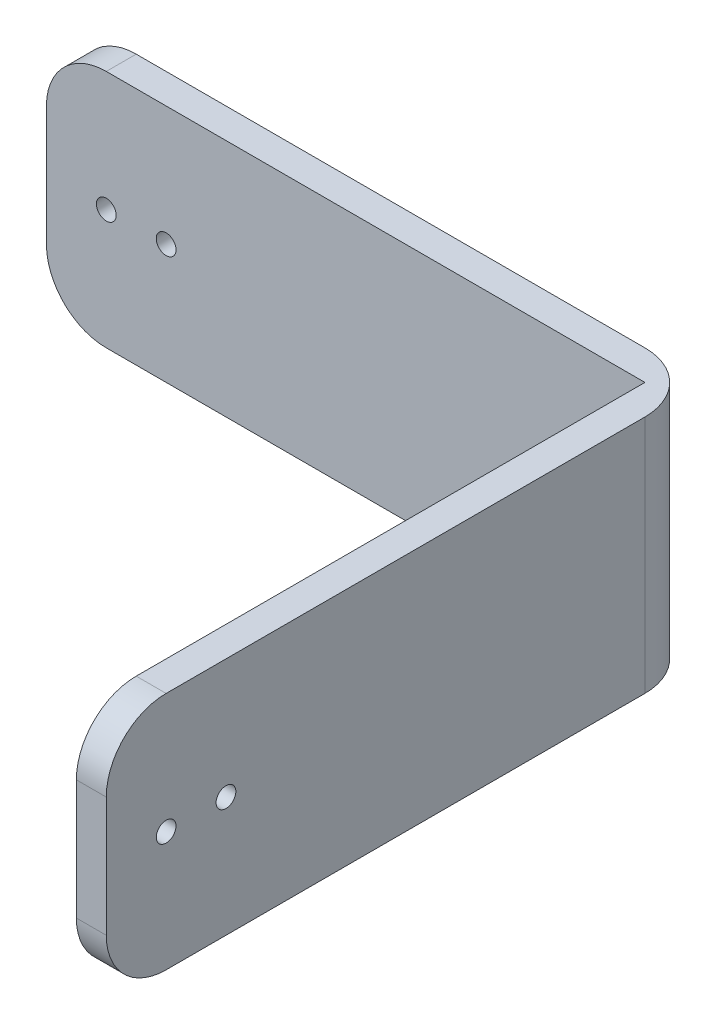
ISO-10303-21;
HEADER;
FILE_DESCRIPTION(('STEP AP214'),'2;1');
FILE_NAME('part.step','',(''),(''),'','','');
FILE_SCHEMA(('AUTOMOTIVE_DESIGN { 1 0 10303 214 1 1 1 1 }'));
ENDSEC;
DATA;
#1=APPLICATION_CONTEXT('core data for automotive mechanical design processes');
#2=APPLICATION_PROTOCOL_DEFINITION('international standard','automotive_design',2000,#1);
#3=PRODUCT_CONTEXT('',#1,'mechanical');
#4=PRODUCT('Part','Part','',(#3));
#5=PRODUCT_RELATED_PRODUCT_CATEGORY('part','',(#4));
#6=PRODUCT_DEFINITION_FORMATION('','',#4);
#7=PRODUCT_DEFINITION_CONTEXT('part definition',#1,'design');
#8=PRODUCT_DEFINITION('design','',#6,#7);
#9=PRODUCT_DEFINITION_SHAPE('','',#8);
#10=(LENGTH_UNIT() NAMED_UNIT(*) SI_UNIT(.MILLI.,.METRE.));
#11=(NAMED_UNIT(*) PLANE_ANGLE_UNIT() SI_UNIT($,.RADIAN.));
#12=(NAMED_UNIT(*) SI_UNIT($,.STERADIAN.) SOLID_ANGLE_UNIT());
#13=UNCERTAINTY_MEASURE_WITH_UNIT(LENGTH_MEASURE(1.E-05),#10,'distance_accuracy_value','');
#14=(GEOMETRIC_REPRESENTATION_CONTEXT(3) GLOBAL_UNCERTAINTY_ASSIGNED_CONTEXT((#13)) GLOBAL_UNIT_ASSIGNED_CONTEXT((#10,
#11,#12)) REPRESENTATION_CONTEXT('',''));
#15=CARTESIAN_POINT('',(0.,0.,0.));
#16=DIRECTION('',(0.,0.,1.));
#17=DIRECTION('',(1.,0.,0.));
#18=AXIS2_PLACEMENT_3D('',#15,#16,#17);
#19=CARTESIAN_POINT('',(-52.8295009050817,19.4147504525408,-1.));
#20=DIRECTION('',(0.,-1.,0.));
#21=DIRECTION('',(0.,0.,-1.));
#22=AXIS2_PLACEMENT_3D('',#19,#20,#21);
#23=PLANE('',#22);
#24=DIRECTION('',(1.,0.,0.));
#25=VECTOR('',#24,1.);
#26=CARTESIAN_POINT('',(-52.8295009050817,19.4147504525408,-1.));
#27=LINE('',#26,#25);
#28=CARTESIAN_POINT('',(-52.8295009050817,19.4147504525408,-1.));
#29=VERTEX_POINT('',#28);
#30=CARTESIAN_POINT('',(-35.8295009050817,19.4147504525408,-1.));
#31=VERTEX_POINT('',#30);
#32=EDGE_CURVE('E167',#29,#31,#27,.T.);
#33=ORIENTED_EDGE('',*,*,#32,.T.);
#34=CARTESIAN_POINT('',(-35.8295009050817,19.4147504525408,1.));
#35=DIRECTION('',(0.,-1.,0.));
#36=DIRECTION('',(0.,0.,-1.));
#37=AXIS2_PLACEMENT_3D('',#34,#35,#36);
#38=CIRCLE('',#37,2.);
#39=CARTESIAN_POINT('',(-33.8295009050817,19.4147504525408,1.));
#40=VERTEX_POINT('',#39);
#41=EDGE_CURVE('E11',#31,#40,#38,.T.);
#42=ORIENTED_EDGE('',*,*,#41,.T.);
#43=DIRECTION('',(0.,0.,-1.));
#44=VECTOR('',#43,1.);
#45=CARTESIAN_POINT('',(-33.8295009050817,19.4147504525408,-1.));
#46=LINE('',#45,#44);
#47=CARTESIAN_POINT('',(-33.8295009050817,19.4147504525408,17.));
#48=VERTEX_POINT('',#47);
#49=EDGE_CURVE('E143',#48,#40,#46,.T.);
#50=ORIENTED_EDGE('',*,*,#49,.F.);
#51=DIRECTION('',(-1.,0.,0.));
#52=VECTOR('',#51,1.);
#53=CARTESIAN_POINT('',(-33.8295009050817,19.4147504525408,17.));
#54=LINE('',#53,#52);
#55=CARTESIAN_POINT('',(-34.8295009050817,19.4147504525408,17.));
#56=VERTEX_POINT('',#55);
#57=EDGE_CURVE('E145',#48,#56,#54,.T.);
#58=ORIENTED_EDGE('',*,*,#57,.T.);
#59=DIRECTION('',(0.,0.,-1.));
#60=VECTOR('',#59,1.);
#61=CARTESIAN_POINT('',(-34.8295009050817,19.4147504525408,-1.));
#62=LINE('',#61,#60);
#63=CARTESIAN_POINT('',(-34.8295009050817,19.4147504525408,0.));
#64=VERTEX_POINT('',#63);
#65=EDGE_CURVE('E121',#56,#64,#62,.T.);
#66=ORIENTED_EDGE('',*,*,#65,.T.);
#67=DIRECTION('',(1.,0.,0.));
#68=VECTOR('',#67,1.);
#69=CARTESIAN_POINT('',(-52.8295009050817,19.4147504525408,0.));
#70=LINE('',#69,#68);
#71=CARTESIAN_POINT('',(-52.8295009050817,19.4147504525408,0.));
#72=VERTEX_POINT('',#71);
#73=EDGE_CURVE('E158',#72,#64,#70,.T.);
#74=ORIENTED_EDGE('',*,*,#73,.F.);
#75=DIRECTION('',(0.,0.,1.));
#76=VECTOR('',#75,1.);
#77=CARTESIAN_POINT('',(-52.8295009050817,19.4147504525408,-1.));
#78=LINE('',#77,#76);
#79=EDGE_CURVE('E196',#29,#72,#78,.T.);
#80=ORIENTED_EDGE('',*,*,#79,.F.);
#81=EDGE_LOOP('',(#33,#42,#50,#58,#66,#74,#80));
#82=FACE_BOUND('',#81,.T.);
#83=ADVANCED_FACE('F31',(#82),#23,.T.);
#84=CARTESIAN_POINT('',(-52.8295009050817,21.4147504525408,-1.));
#85=DIRECTION('',(0.,0.,1.));
#86=DIRECTION('',(1.,0.,0.));
#87=AXIS2_PLACEMENT_3D('',#84,#85,#86);
#88=CYLINDRICAL_SURFACE('',#87,2.);
#89=CARTESIAN_POINT('',(-52.8295009050817,21.4147504525408,0.));
#90=DIRECTION('',(0.,0.,1.));
#91=DIRECTION('',(1.,0.,0.));
#92=AXIS2_PLACEMENT_3D('',#89,#90,#91);
#93=CIRCLE('',#92,2.);
#94=CARTESIAN_POINT('',(-54.8295009050817,21.4147504525409,0.));
#95=VERTEX_POINT('',#94);
#96=EDGE_CURVE('E183',#95,#72,#93,.T.);
#97=ORIENTED_EDGE('',*,*,#96,.F.);
#98=DIRECTION('',(0.,0.,1.));
#99=VECTOR('',#98,1.);
#100=CARTESIAN_POINT('',(-54.8295009050817,21.4147504525409,-1.));
#101=LINE('',#100,#99);
#102=CARTESIAN_POINT('',(-54.8295009050817,21.4147504525409,-1.));
#103=VERTEX_POINT('',#102);
#104=EDGE_CURVE('E197',#103,#95,#101,.T.);
#105=ORIENTED_EDGE('',*,*,#104,.F.);
#106=CARTESIAN_POINT('',(-52.8295009050817,21.4147504525408,-1.));
#107=DIRECTION('',(0.,0.,1.));
#108=DIRECTION('',(1.,0.,0.));
#109=AXIS2_PLACEMENT_3D('',#106,#107,#108);
#110=CIRCLE('',#109,2.);
#111=EDGE_CURVE('E164',#103,#29,#110,.T.);
#112=ORIENTED_EDGE('',*,*,#111,.T.);
#113=ORIENTED_EDGE('',*,*,#79,.T.);
#114=EDGE_LOOP('',(#97,#105,#112,#113));
#115=FACE_BOUND('',#114,.T.);
#116=ADVANCED_FACE('F247',(#115),#88,.T.);
#117=CARTESIAN_POINT('',(-54.8295009050817,25.4147504525408,-1.));
#118=DIRECTION('',(-1.,0.,0.));
#119=DIRECTION('',(0.,0.,1.));
#120=AXIS2_PLACEMENT_3D('',#117,#118,#119);
#121=PLANE('',#120);
#122=DIRECTION('',(0.,-1.,0.));
#123=VECTOR('',#122,1.);
#124=CARTESIAN_POINT('',(-54.8295009050817,25.4147504525408,0.));
#125=LINE('',#124,#123);
#126=CARTESIAN_POINT('',(-54.8295009050817,25.4147504525408,0.));
#127=VERTEX_POINT('',#126);
#128=EDGE_CURVE('E210',#127,#95,#125,.T.);
#129=ORIENTED_EDGE('',*,*,#128,.F.);
#130=DIRECTION('',(0.,0.,1.));
#131=VECTOR('',#130,1.);
#132=CARTESIAN_POINT('',(-54.8295009050817,25.4147504525408,-1.));
#133=LINE('',#132,#131);
#134=CARTESIAN_POINT('',(-54.8295009050817,25.4147504525408,-1.));
#135=VERTEX_POINT('',#134);
#136=EDGE_CURVE('E202',#135,#127,#133,.T.);
#137=ORIENTED_EDGE('',*,*,#136,.F.);
#138=DIRECTION('',(0.,-1.,0.));
#139=VECTOR('',#138,1.);
#140=CARTESIAN_POINT('',(-54.8295009050817,25.4147504525408,-1.));
#141=LINE('',#140,#139);
#142=EDGE_CURVE('E161',#135,#103,#141,.T.);
#143=ORIENTED_EDGE('',*,*,#142,.T.);
#144=ORIENTED_EDGE('',*,*,#104,.T.);
#145=EDGE_LOOP('',(#129,#137,#143,#144));
#146=FACE_BOUND('',#145,.T.);
#147=ADVANCED_FACE('F245',(#146),#121,.T.);
#148=CARTESIAN_POINT('',(-52.8295009050817,25.4147504525408,-1.));
#149=DIRECTION('',(0.,0.,1.));
#150=DIRECTION('',(1.,0.,0.));
#151=AXIS2_PLACEMENT_3D('',#148,#149,#150);
#152=CYLINDRICAL_SURFACE('',#151,2.);
#153=CARTESIAN_POINT('',(-52.8295009050817,25.4147504525408,0.));
#154=DIRECTION('',(0.,0.,1.));
#155=DIRECTION('',(1.,0.,0.));
#156=AXIS2_PLACEMENT_3D('',#153,#154,#155);
#157=CIRCLE('',#156,2.);
#158=CARTESIAN_POINT('',(-52.8295009050817,27.4147504525408,0.));
#159=VERTEX_POINT('',#158);
#160=EDGE_CURVE('E172',#159,#127,#157,.T.);
#161=ORIENTED_EDGE('',*,*,#160,.F.);
#162=DIRECTION('',(0.,0.,1.));
#163=VECTOR('',#162,1.);
#164=CARTESIAN_POINT('',(-52.8295009050817,27.4147504525408,-1.));
#165=LINE('',#164,#163);
#166=CARTESIAN_POINT('',(-52.8295009050817,27.4147504525408,-1.));
#167=VERTEX_POINT('',#166);
#168=EDGE_CURVE('E169',#167,#159,#165,.T.);
#169=ORIENTED_EDGE('',*,*,#168,.F.);
#170=CARTESIAN_POINT('',(-52.8295009050817,25.4147504525408,-1.));
#171=DIRECTION('',(0.,0.,1.));
#172=DIRECTION('',(1.,0.,0.));
#173=AXIS2_PLACEMENT_3D('',#170,#171,#172);
#174=CIRCLE('',#173,2.);
#175=EDGE_CURVE('E157',#167,#135,#174,.T.);
#176=ORIENTED_EDGE('',*,*,#175,.T.);
#177=ORIENTED_EDGE('',*,*,#136,.T.);
#178=EDGE_LOOP('',(#161,#169,#176,#177));
#179=FACE_BOUND('',#178,.T.);
#180=ADVANCED_FACE('F242',(#179),#152,.T.);
#181=CARTESIAN_POINT('',(-52.8295009050817,27.4147504525408,-1.));
#182=DIRECTION('',(0.,1.,0.));
#183=DIRECTION('',(0.,0.,1.));
#184=AXIS2_PLACEMENT_3D('',#181,#182,#183);
#185=PLANE('',#184);
#186=DIRECTION('',(0.,0.,1.));
#187=VECTOR('',#186,1.);
#188=CARTESIAN_POINT('',(-33.8295009050817,27.4147504525408,-1.));
#189=LINE('',#188,#187);
#190=CARTESIAN_POINT('',(-33.8295009050817,27.4147504525408,1.));
#191=VERTEX_POINT('',#190);
#192=CARTESIAN_POINT('',(-33.8295009050817,27.4147504525408,17.));
#193=VERTEX_POINT('',#192);
#194=EDGE_CURVE('E112',#191,#193,#189,.T.);
#195=ORIENTED_EDGE('',*,*,#194,.F.);
#196=CARTESIAN_POINT('',(-35.8295009050817,27.4147504525408,1.));
#197=DIRECTION('',(0.,1.,0.));
#198=DIRECTION('',(0.,0.,1.));
#199=AXIS2_PLACEMENT_3D('',#196,#197,#198);
#200=CIRCLE('',#199,2.);
#201=CARTESIAN_POINT('',(-35.8295009050817,27.4147504525408,-1.));
#202=VERTEX_POINT('',#201);
#203=EDGE_CURVE('E53',#191,#202,#200,.T.);
#204=ORIENTED_EDGE('',*,*,#203,.T.);
#205=DIRECTION('',(-1.,0.,0.));
#206=VECTOR('',#205,1.);
#207=CARTESIAN_POINT('',(-52.8295009050817,27.4147504525408,-1.));
#208=LINE('',#207,#206);
#209=EDGE_CURVE('E155',#202,#167,#208,.T.);
#210=ORIENTED_EDGE('',*,*,#209,.T.);
#211=ORIENTED_EDGE('',*,*,#168,.T.);
#212=DIRECTION('',(-1.,0.,0.));
#213=VECTOR('',#212,1.);
#214=CARTESIAN_POINT('',(-52.8295009050817,27.4147504525408,0.));
#215=LINE('',#214,#213);
#216=CARTESIAN_POINT('',(-34.8295009050817,27.4147504525408,0.));
#217=VERTEX_POINT('',#216);
#218=EDGE_CURVE('E178',#217,#159,#215,.T.);
#219=ORIENTED_EDGE('',*,*,#218,.F.);
#220=DIRECTION('',(0.,0.,1.));
#221=VECTOR('',#220,1.);
#222=CARTESIAN_POINT('',(-34.8295009050817,27.4147504525408,-1.));
#223=LINE('',#222,#221);
#224=CARTESIAN_POINT('',(-34.8295009050817,27.4147504525408,17.));
#225=VERTEX_POINT('',#224);
#226=EDGE_CURVE('E127',#217,#225,#223,.T.);
#227=ORIENTED_EDGE('',*,*,#226,.T.);
#228=DIRECTION('',(-1.,0.,0.));
#229=VECTOR('',#228,1.);
#230=CARTESIAN_POINT('',(-33.8295009050817,27.4147504525408,17.));
#231=LINE('',#230,#229);
#232=EDGE_CURVE('E124',#193,#225,#231,.T.);
#233=ORIENTED_EDGE('',*,*,#232,.F.);
#234=EDGE_LOOP('',(#195,#204,#210,#211,#219,#227,#233));
#235=FACE_BOUND('',#234,.T.);
#236=ADVANCED_FACE('F125',(#235),#185,.T.);
#237=CARTESIAN_POINT('',(-52.8295009050817,21.4147504525408,-1.));
#238=DIRECTION('',(0.,0.,1.));
#239=DIRECTION('',(1.,0.,0.));
#240=AXIS2_PLACEMENT_3D('',#237,#238,#239);
#241=PLANE('',#240);
#242=CARTESIAN_POINT('',(-50.8295009050817,23.4147504525408,-1.));
#243=DIRECTION('',(0.,0.,1.));
#244=DIRECTION('',(1.,0.,0.));
#245=AXIS2_PLACEMENT_3D('',#242,#243,#244);
#246=CIRCLE('',#245,0.330199999999996);
#247=CARTESIAN_POINT('',(-50.4993009050817,23.4147504525408,-1.));
#248=VERTEX_POINT('',#247);
#249=EDGE_CURVE('E320',#248,#248,#246,.T.);
#250=ORIENTED_EDGE('',*,*,#249,.T.);
#251=EDGE_LOOP('',(#250));
#252=FACE_BOUND('',#251,.T.);
#253=CARTESIAN_POINT('',(-52.8295009050817,23.4147504525408,-0.999999999999994));
#254=DIRECTION('',(0.,0.,1.));
#255=DIRECTION('',(1.,0.,0.));
#256=AXIS2_PLACEMENT_3D('',#253,#254,#255);
#257=CIRCLE('',#256,0.330200000000003);
#258=CARTESIAN_POINT('',(-52.4993009050817,23.4147504525408,-0.999999999999994));
#259=VERTEX_POINT('',#258);
#260=EDGE_CURVE('E153',#259,#259,#257,.T.);
#261=ORIENTED_EDGE('',*,*,#260,.T.);
#262=EDGE_LOOP('',(#261));
#263=FACE_BOUND('',#262,.T.);
#264=ORIENTED_EDGE('',*,*,#209,.F.);
#265=DIRECTION('',(0.,1.,0.));
#266=VECTOR('',#265,1.);
#267=CARTESIAN_POINT('',(-35.8295009050817,19.4147504525408,-1.));
#268=LINE('',#267,#266);
#269=EDGE_CURVE('E39',#202,#31,#268,.F.);
#270=ORIENTED_EDGE('',*,*,#269,.T.);
#271=ORIENTED_EDGE('',*,*,#32,.F.);
#272=ORIENTED_EDGE('',*,*,#111,.F.);
#273=ORIENTED_EDGE('',*,*,#142,.F.);
#274=ORIENTED_EDGE('',*,*,#175,.F.);
#275=EDGE_LOOP('',(#264,#270,#271,#272,#273,#274));
#276=FACE_BOUND('',#275,.T.);
#277=ADVANCED_FACE('F248',(#252,#263,#276),#241,.F.);
#278=CARTESIAN_POINT('',(-52.8295009050817,21.4147504525408,0.));
#279=DIRECTION('',(0.,0.,1.));
#280=DIRECTION('',(1.,0.,0.));
#281=AXIS2_PLACEMENT_3D('',#278,#279,#280);
#282=PLANE('',#281);
#283=CARTESIAN_POINT('',(-50.8295009050817,23.4147504525408,0.));
#284=DIRECTION('',(0.,0.,1.));
#285=DIRECTION('',(1.,0.,0.));
#286=AXIS2_PLACEMENT_3D('',#283,#284,#285);
#287=CIRCLE('',#286,0.330199999999989);
#288=CARTESIAN_POINT('',(-50.4993009050817,23.4147504525408,0.));
#289=VERTEX_POINT('',#288);
#290=EDGE_CURVE('E189',#289,#289,#287,.T.);
#291=ORIENTED_EDGE('',*,*,#290,.F.);
#292=EDGE_LOOP('',(#291));
#293=FACE_BOUND('',#292,.T.);
#294=CARTESIAN_POINT('',(-52.8295009050817,23.4147504525408,0.));
#295=DIRECTION('',(0.,0.,1.));
#296=DIRECTION('',(1.,0.,0.));
#297=AXIS2_PLACEMENT_3D('',#294,#295,#296);
#298=CIRCLE('',#297,0.330200000000003);
#299=CARTESIAN_POINT('',(-52.4993009050817,23.4147504525408,0.));
#300=VERTEX_POINT('',#299);
#301=EDGE_CURVE('E322',#300,#300,#298,.T.);
#302=ORIENTED_EDGE('',*,*,#301,.F.);
#303=EDGE_LOOP('',(#302));
#304=FACE_BOUND('',#303,.T.);
#305=DIRECTION('',(0.,1.,0.));
#306=VECTOR('',#305,1.);
#307=CARTESIAN_POINT('',(-34.8295009050817,27.4147504525408,0.));
#308=LINE('',#307,#306);
#309=EDGE_CURVE('E130',#64,#217,#308,.T.);
#310=ORIENTED_EDGE('',*,*,#309,.T.);
#311=ORIENTED_EDGE('',*,*,#218,.T.);
#312=ORIENTED_EDGE('',*,*,#160,.T.);
#313=ORIENTED_EDGE('',*,*,#128,.T.);
#314=ORIENTED_EDGE('',*,*,#96,.T.);
#315=ORIENTED_EDGE('',*,*,#73,.T.);
#316=EDGE_LOOP('',(#310,#311,#312,#313,#314,#315));
#317=FACE_BOUND('',#316,.T.);
#318=ADVANCED_FACE('F215',(#293,#304,#317),#282,.T.);
#319=CARTESIAN_POINT('',(-33.8295009050817,25.4147504525408,17.));
#320=DIRECTION('',(-1.,0.,0.));
#321=DIRECTION('',(0.,0.,1.));
#322=AXIS2_PLACEMENT_3D('',#319,#320,#321);
#323=CYLINDRICAL_SURFACE('',#322,2.);
#324=CARTESIAN_POINT('',(-34.8295009050817,25.4147504525408,17.));
#325=DIRECTION('',(1.,0.,0.));
#326=DIRECTION('',(0.,0.,1.));
#327=AXIS2_PLACEMENT_3D('',#324,#325,#326);
#328=CIRCLE('',#327,2.);
#329=CARTESIAN_POINT('',(-34.8295009050817,25.4147504525408,19.));
#330=VERTEX_POINT('',#329);
#331=EDGE_CURVE('E148',#225,#330,#328,.T.);
#332=ORIENTED_EDGE('',*,*,#331,.T.);
#333=DIRECTION('',(-1.,0.,0.));
#334=VECTOR('',#333,1.);
#335=CARTESIAN_POINT('',(-33.8295009050817,25.4147504525408,19.));
#336=LINE('',#335,#334);
#337=CARTESIAN_POINT('',(-33.8295009050817,25.4147504525408,19.));
#338=VERTEX_POINT('',#337);
#339=EDGE_CURVE('E131',#338,#330,#336,.T.);
#340=ORIENTED_EDGE('',*,*,#339,.F.);
#341=CARTESIAN_POINT('',(-33.8295009050817,25.4147504525408,17.));
#342=DIRECTION('',(1.,0.,0.));
#343=DIRECTION('',(0.,0.,1.));
#344=AXIS2_PLACEMENT_3D('',#341,#342,#343);
#345=CIRCLE('',#344,2.);
#346=EDGE_CURVE('E117',#193,#338,#345,.T.);
#347=ORIENTED_EDGE('',*,*,#346,.F.);
#348=ORIENTED_EDGE('',*,*,#232,.T.);
#349=EDGE_LOOP('',(#332,#340,#347,#348));
#350=FACE_BOUND('',#349,.T.);
#351=ADVANCED_FACE('F133',(#350),#323,.T.);
#352=CARTESIAN_POINT('',(-33.8295009050817,25.4147504525408,19.));
#353=DIRECTION('',(0.,0.,-1.));
#354=DIRECTION('',(0.,1.,0.));
#355=AXIS2_PLACEMENT_3D('',#352,#353,#354);
#356=PLANE('',#355);
#357=DIRECTION('',(0.,-1.,0.));
#358=VECTOR('',#357,1.);
#359=CARTESIAN_POINT('',(-34.8295009050817,25.4147504525408,19.));
#360=LINE('',#359,#358);
#361=CARTESIAN_POINT('',(-34.8295009050817,21.4147504525409,19.));
#362=VERTEX_POINT('',#361);
#363=EDGE_CURVE('E225',#330,#362,#360,.T.);
#364=ORIENTED_EDGE('',*,*,#363,.T.);
#365=DIRECTION('',(-1.,0.,0.));
#366=VECTOR('',#365,1.);
#367=CARTESIAN_POINT('',(-33.8295009050817,21.4147504525409,19.));
#368=LINE('',#367,#366);
#369=CARTESIAN_POINT('',(-33.8295009050817,21.4147504525409,19.));
#370=VERTEX_POINT('',#369);
#371=EDGE_CURVE('E232',#370,#362,#368,.T.);
#372=ORIENTED_EDGE('',*,*,#371,.F.);
#373=DIRECTION('',(0.,-1.,0.));
#374=VECTOR('',#373,1.);
#375=CARTESIAN_POINT('',(-33.8295009050817,25.4147504525408,19.));
#376=LINE('',#375,#374);
#377=EDGE_CURVE('E136',#338,#370,#376,.T.);
#378=ORIENTED_EDGE('',*,*,#377,.F.);
#379=ORIENTED_EDGE('',*,*,#339,.T.);
#380=EDGE_LOOP('',(#364,#372,#378,#379));
#381=FACE_BOUND('',#380,.T.);
#382=ADVANCED_FACE('F236',(#381),#356,.F.);
#383=CARTESIAN_POINT('',(-33.8295009050817,21.4147504525408,17.));
#384=DIRECTION('',(-1.,0.,0.));
#385=DIRECTION('',(0.,0.,1.));
#386=AXIS2_PLACEMENT_3D('',#383,#384,#385);
#387=CYLINDRICAL_SURFACE('',#386,2.);
#388=CARTESIAN_POINT('',(-34.8295009050817,21.4147504525408,17.));
#389=DIRECTION('',(1.,0.,0.));
#390=DIRECTION('',(0.,0.,-1.));
#391=AXIS2_PLACEMENT_3D('',#388,#389,#390);
#392=CIRCLE('',#391,2.);
#393=EDGE_CURVE('E224',#362,#56,#392,.T.);
#394=ORIENTED_EDGE('',*,*,#393,.T.);
#395=ORIENTED_EDGE('',*,*,#57,.F.);
#396=CARTESIAN_POINT('',(-33.8295009050817,21.4147504525408,17.));
#397=DIRECTION('',(1.,0.,0.));
#398=DIRECTION('',(0.,0.,-1.));
#399=AXIS2_PLACEMENT_3D('',#396,#397,#398);
#400=CIRCLE('',#399,2.);
#401=EDGE_CURVE('E138',#370,#48,#400,.T.);
#402=ORIENTED_EDGE('',*,*,#401,.F.);
#403=ORIENTED_EDGE('',*,*,#371,.T.);
#404=EDGE_LOOP('',(#394,#395,#402,#403));
#405=FACE_BOUND('',#404,.T.);
#406=ADVANCED_FACE('F289',(#405),#387,.T.);
#407=CARTESIAN_POINT('',(-33.8295009050817,21.4147504525408,17.));
#408=DIRECTION('',(1.,0.,0.));
#409=DIRECTION('',(0.,0.,-1.));
#410=AXIS2_PLACEMENT_3D('',#407,#408,#409);
#411=PLANE('',#410);
#412=CARTESIAN_POINT('',(-33.8295009050817,23.4147504525408,15.));
#413=DIRECTION('',(1.,0.,0.));
#414=DIRECTION('',(0.,0.,-1.));
#415=AXIS2_PLACEMENT_3D('',#412,#413,#414);
#416=CIRCLE('',#415,0.330199999999985);
#417=CARTESIAN_POINT('',(-33.8295009050817,23.4147504525408,14.6698));
#418=VERTEX_POINT('',#417);
#419=EDGE_CURVE('E194',#418,#418,#416,.T.);
#420=ORIENTED_EDGE('',*,*,#419,.F.);
#421=EDGE_LOOP('',(#420));
#422=FACE_BOUND('',#421,.T.);
#423=CARTESIAN_POINT('',(-33.8295009050817,23.4147504525408,17.));
#424=DIRECTION('',(1.,0.,0.));
#425=DIRECTION('',(0.,0.,-1.));
#426=AXIS2_PLACEMENT_3D('',#423,#424,#425);
#427=CIRCLE('',#426,0.330199999999985);
#428=CARTESIAN_POINT('',(-33.8295009050817,23.4147504525408,16.6698));
#429=VERTEX_POINT('',#428);
#430=EDGE_CURVE('E190',#429,#429,#427,.T.);
#431=ORIENTED_EDGE('',*,*,#430,.F.);
#432=EDGE_LOOP('',(#431));
#433=FACE_BOUND('',#432,.T.);
#434=ORIENTED_EDGE('',*,*,#49,.T.);
#435=DIRECTION('',(0.,1.,0.));
#436=VECTOR('',#435,1.);
#437=CARTESIAN_POINT('',(-33.8295009050817,27.4147504525408,1.));
#438=LINE('',#437,#436);
#439=EDGE_CURVE('E120',#40,#191,#438,.T.);
#440=ORIENTED_EDGE('',*,*,#439,.T.);
#441=ORIENTED_EDGE('',*,*,#194,.T.);
#442=ORIENTED_EDGE('',*,*,#346,.T.);
#443=ORIENTED_EDGE('',*,*,#377,.T.);
#444=ORIENTED_EDGE('',*,*,#401,.T.);
#445=EDGE_LOOP('',(#434,#440,#441,#442,#443,#444));
#446=FACE_BOUND('',#445,.T.);
#447=ADVANCED_FACE('F115',(#422,#433,#446),#411,.T.);
#448=CARTESIAN_POINT('',(-34.8295009050817,21.4147504525408,17.));
#449=DIRECTION('',(1.,0.,0.));
#450=DIRECTION('',(0.,0.,-1.));
#451=AXIS2_PLACEMENT_3D('',#448,#449,#450);
#452=PLANE('',#451);
#453=CARTESIAN_POINT('',(-34.8295009050817,23.4147504525408,15.));
#454=DIRECTION('',(1.,0.,0.));
#455=DIRECTION('',(0.,0.,-1.));
#456=AXIS2_PLACEMENT_3D('',#453,#454,#455);
#457=CIRCLE('',#456,0.330199999999991);
#458=CARTESIAN_POINT('',(-34.8295009050817,23.4147504525408,14.6698));
#459=VERTEX_POINT('',#458);
#460=EDGE_CURVE('E191',#459,#459,#457,.T.);
#461=ORIENTED_EDGE('',*,*,#460,.T.);
#462=EDGE_LOOP('',(#461));
#463=FACE_BOUND('',#462,.T.);
#464=CARTESIAN_POINT('',(-34.8295009050817,23.4147504525408,17.));
#465=DIRECTION('',(1.,0.,0.));
#466=DIRECTION('',(0.,0.,-1.));
#467=AXIS2_PLACEMENT_3D('',#464,#465,#466);
#468=CIRCLE('',#467,0.330199999999991);
#469=CARTESIAN_POINT('',(-34.8295009050817,23.4147504525408,16.6698));
#470=VERTEX_POINT('',#469);
#471=EDGE_CURVE('E186',#470,#470,#468,.T.);
#472=ORIENTED_EDGE('',*,*,#471,.T.);
#473=EDGE_LOOP('',(#472));
#474=FACE_BOUND('',#473,.T.);
#475=ORIENTED_EDGE('',*,*,#309,.F.);
#476=ORIENTED_EDGE('',*,*,#65,.F.);
#477=ORIENTED_EDGE('',*,*,#393,.F.);
#478=ORIENTED_EDGE('',*,*,#363,.F.);
#479=ORIENTED_EDGE('',*,*,#331,.F.);
#480=ORIENTED_EDGE('',*,*,#226,.F.);
#481=EDGE_LOOP('',(#475,#476,#477,#478,#479,#480));
#482=FACE_BOUND('',#481,.T.);
#483=ADVANCED_FACE('F238',(#463,#474,#482),#452,.F.);
#484=CARTESIAN_POINT('',(-52.8295009050817,23.4147504525408,0.));
#485=DIRECTION('',(0.,0.,1.));
#486=DIRECTION('',(1.,0.,0.));
#487=AXIS2_PLACEMENT_3D('',#484,#485,#486);
#488=CYLINDRICAL_SURFACE('',#487,0.330200000000003);
#489=ORIENTED_EDGE('',*,*,#260,.F.);
#490=EDGE_LOOP('',(#489));
#491=FACE_BOUND('',#490,.T.);
#492=ORIENTED_EDGE('',*,*,#301,.T.);
#493=EDGE_LOOP('',(#492));
#494=FACE_BOUND('',#493,.T.);
#495=ADVANCED_FACE('F294',(#491,#494),#488,.F.);
#496=CARTESIAN_POINT('',(-50.8295009050817,23.4147504525408,0.));
#497=DIRECTION('',(0.,0.,1.));
#498=DIRECTION('',(1.,0.,0.));
#499=AXIS2_PLACEMENT_3D('',#496,#497,#498);
#500=CYLINDRICAL_SURFACE('',#499,0.330199999999992);
#501=ORIENTED_EDGE('',*,*,#249,.F.);
#502=EDGE_LOOP('',(#501));
#503=FACE_BOUND('',#502,.T.);
#504=ORIENTED_EDGE('',*,*,#290,.T.);
#505=EDGE_LOOP('',(#504));
#506=FACE_BOUND('',#505,.T.);
#507=ADVANCED_FACE('F300',(#503,#506),#500,.F.);
#508=CARTESIAN_POINT('',(-33.8295009050817,23.4147504525408,17.));
#509=DIRECTION('',(1.,0.,0.));
#510=DIRECTION('',(0.,0.,-1.));
#511=AXIS2_PLACEMENT_3D('',#508,#509,#510);
#512=CYLINDRICAL_SURFACE('',#511,0.330199999999991);
#513=ORIENTED_EDGE('',*,*,#430,.T.);
#514=EDGE_LOOP('',(#513));
#515=FACE_BOUND('',#514,.T.);
#516=ORIENTED_EDGE('',*,*,#471,.F.);
#517=EDGE_LOOP('',(#516));
#518=FACE_BOUND('',#517,.T.);
#519=ADVANCED_FACE('F256',(#515,#518),#512,.F.);
#520=CARTESIAN_POINT('',(-33.8295009050817,23.4147504525408,15.));
#521=DIRECTION('',(1.,0.,0.));
#522=DIRECTION('',(0.,0.,-1.));
#523=AXIS2_PLACEMENT_3D('',#520,#521,#522);
#524=CYLINDRICAL_SURFACE('',#523,0.330199999999991);
#525=ORIENTED_EDGE('',*,*,#419,.T.);
#526=EDGE_LOOP('',(#525));
#527=FACE_BOUND('',#526,.T.);
#528=ORIENTED_EDGE('',*,*,#460,.F.);
#529=EDGE_LOOP('',(#528));
#530=FACE_BOUND('',#529,.T.);
#531=ADVANCED_FACE('F252',(#527,#530),#524,.F.);
#532=CARTESIAN_POINT('',(-35.8295009050817,21.4147504525408,1.));
#533=DIRECTION('',(0.,-1.,0.));
#534=DIRECTION('',(0.,0.,-1.));
#535=AXIS2_PLACEMENT_3D('',#532,#533,#534);
#536=CYLINDRICAL_SURFACE('',#535,2.);
#537=ORIENTED_EDGE('',*,*,#41,.F.);
#538=ORIENTED_EDGE('',*,*,#269,.F.);
#539=ORIENTED_EDGE('',*,*,#203,.F.);
#540=ORIENTED_EDGE('',*,*,#439,.F.);
#541=EDGE_LOOP('',(#537,#538,#539,#540));
#542=FACE_BOUND('',#541,.T.);
#543=ADVANCED_FACE('F33',(#542),#536,.T.);
#544=CLOSED_SHELL('',(#83,#116,#147,#180,#236,#277,#318,#351,#382,#406,#447,#483,#495,#507,#519,
#531,#543));
#545=MANIFOLD_SOLID_BREP('B2',#544);
#546=ADVANCED_BREP_SHAPE_REPRESENTATION('',(#18,#545),#14);
#547=SHAPE_DEFINITION_REPRESENTATION(#9,#546);
ENDSEC;
END-ISO-10303-21;
